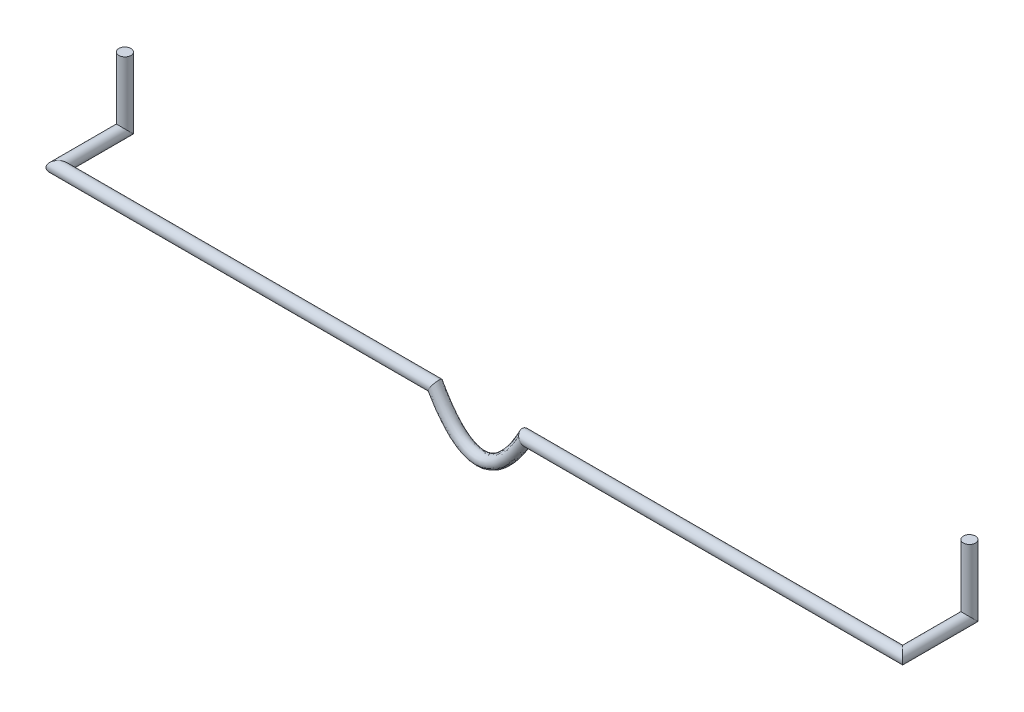
ISO-10303-21;
HEADER;
FILE_DESCRIPTION(('STEP AP214'),'2;1');
FILE_NAME('part.step','',(''),(''),'','','');
FILE_SCHEMA(('AUTOMOTIVE_DESIGN { 1 0 10303 214 1 1 1 1 }'));
ENDSEC;
DATA;
#1=APPLICATION_CONTEXT('core data for automotive mechanical design processes');
#2=APPLICATION_PROTOCOL_DEFINITION('international standard','automotive_design',2000,#1);
#3=PRODUCT_CONTEXT('',#1,'mechanical');
#4=PRODUCT('Part','Part','',(#3));
#5=PRODUCT_RELATED_PRODUCT_CATEGORY('part','',(#4));
#6=PRODUCT_DEFINITION_FORMATION('','',#4);
#7=PRODUCT_DEFINITION_CONTEXT('part definition',#1,'design');
#8=PRODUCT_DEFINITION('design','',#6,#7);
#9=PRODUCT_DEFINITION_SHAPE('','',#8);
#10=(LENGTH_UNIT() NAMED_UNIT(*) SI_UNIT(.MILLI.,.METRE.));
#11=(NAMED_UNIT(*) PLANE_ANGLE_UNIT() SI_UNIT($,.RADIAN.));
#12=(NAMED_UNIT(*) SI_UNIT($,.STERADIAN.) SOLID_ANGLE_UNIT());
#13=UNCERTAINTY_MEASURE_WITH_UNIT(LENGTH_MEASURE(1.E-05),#10,'distance_accuracy_value','');
#14=(GEOMETRIC_REPRESENTATION_CONTEXT(3) GLOBAL_UNCERTAINTY_ASSIGNED_CONTEXT((#13)) GLOBAL_UNIT_ASSIGNED_CONTEXT((#10,
#11,#12)) REPRESENTATION_CONTEXT('',''));
#15=CARTESIAN_POINT('',(0.,0.,0.));
#16=DIRECTION('',(0.,0.,1.));
#17=DIRECTION('',(1.,0.,0.));
#18=AXIS2_PLACEMENT_3D('',#15,#16,#17);
#19=CARTESIAN_POINT('',(450.088,0.,0.));
#20=DIRECTION('',(0.,-1.,0.));
#21=DIRECTION('',(0.,0.,1.));
#22=AXIS2_PLACEMENT_3D('',#19,#20,#21);
#23=PLANE('',#22);
#24=CARTESIAN_POINT('',(450.088,0.,0.));
#25=DIRECTION('',(0.,-1.,0.));
#26=DIRECTION('',(0.,0.,1.));
#27=AXIS2_PLACEMENT_3D('',#24,#25,#26);
#28=CIRCLE('',#27,3.2385);
#29=CARTESIAN_POINT('',(450.088,0.,3.23850000000001));
#30=VERTEX_POINT('',#29);
#31=EDGE_CURVE('E38',#30,#30,#28,.T.);
#32=ORIENTED_EDGE('',*,*,#31,.F.);
#33=EDGE_LOOP('',(#32));
#34=FACE_BOUND('',#33,.T.);
#35=ADVANCED_FACE('F35',(#34),#23,.F.);
#36=CARTESIAN_POINT('',(0.,0.,0.));
#37=DIRECTION('',(0.,1.,0.));
#38=DIRECTION('',(0.,0.,1.));
#39=AXIS2_PLACEMENT_3D('',#36,#37,#38);
#40=PLANE('',#39);
#41=CARTESIAN_POINT('',(0.,0.,0.));
#42=DIRECTION('',(0.,1.,0.));
#43=DIRECTION('',(0.,0.,1.));
#44=AXIS2_PLACEMENT_3D('',#41,#42,#43);
#45=CIRCLE('',#44,3.2385);
#46=CARTESIAN_POINT('',(0.,0.,3.2385));
#47=VERTEX_POINT('',#46);
#48=EDGE_CURVE('E43',#47,#47,#45,.T.);
#49=ORIENTED_EDGE('',*,*,#48,.T.);
#50=EDGE_LOOP('',(#49));
#51=FACE_BOUND('',#50,.T.);
#52=ADVANCED_FACE('F119',(#51),#40,.T.);
#53=CARTESIAN_POINT('',(450.088,-39.22235,0.));
#54=DIRECTION('',(0.,1.,0.));
#55=DIRECTION('',(0.,0.,1.));
#56=AXIS2_PLACEMENT_3D('',#53,#54,#55);
#57=CYLINDRICAL_SURFACE('',#56,3.2385);
#58=CARTESIAN_POINT('',(450.088,-35.56,0.));
#59=DIRECTION('',(0.,0.707106781186548,-0.707106781186548));
#60=DIRECTION('',(0.,-0.707106781186548,-0.707106781186548));
#61=AXIS2_PLACEMENT_3D('',#58,#59,#60);
#62=ELLIPSE('',#61,4.57993062174527,3.2385);
#63=CARTESIAN_POINT('',(450.088,-38.7985,-3.23849999999999));
#64=VERTEX_POINT('',#63);
#65=EDGE_CURVE('E53',#64,#64,#62,.T.);
#66=ORIENTED_EDGE('',*,*,#65,.T.);
#67=EDGE_LOOP('',(#66));
#68=FACE_BOUND('',#67,.T.);
#69=ORIENTED_EDGE('',*,*,#31,.T.);
#70=EDGE_LOOP('',(#69));
#71=FACE_BOUND('',#70,.T.);
#72=ADVANCED_FACE('F121',(#68,#71),#57,.T.);
#73=CARTESIAN_POINT('',(450.088,-35.56,42.7847));
#74=DIRECTION('',(0.,0.,-1.));
#75=DIRECTION('',(-1.,0.,0.));
#76=AXIS2_PLACEMENT_3D('',#73,#74,#75);
#77=CYLINDRICAL_SURFACE('',#76,3.2385);
#78=CARTESIAN_POINT('',(450.088,-35.56,35.56));
#79=DIRECTION('',(0.707106781186547,0.,-0.707106781186547));
#80=DIRECTION('',(0.707106781186548,0.,0.707106781186548));
#81=AXIS2_PLACEMENT_3D('',#78,#79,#80);
#82=ELLIPSE('',#81,4.57993062174527,3.2385);
#83=CARTESIAN_POINT('',(453.3265,-35.56,38.7985));
#84=VERTEX_POINT('',#83);
#85=EDGE_CURVE('E156',#84,#84,#82,.T.);
#86=ORIENTED_EDGE('',*,*,#85,.T.);
#87=EDGE_LOOP('',(#86));
#88=FACE_BOUND('',#87,.T.);
#89=ORIENTED_EDGE('',*,*,#65,.F.);
#90=EDGE_LOOP('',(#89));
#91=FACE_BOUND('',#90,.T.);
#92=ADVANCED_FACE('F126',(#88,#91),#77,.T.);
#93=CARTESIAN_POINT('',(246.983876614171,-35.56,35.56));
#94=DIRECTION('',(1.,0.,0.));
#95=DIRECTION('',(0.,0.,-1.));
#96=AXIS2_PLACEMENT_3D('',#93,#94,#95);
#97=CYLINDRICAL_SURFACE('',#96,3.2385);
#98=CARTESIAN_POINT('',(249.174,-35.56,32.3215));
#99=CARTESIAN_POINT('',(249.176054793598,-35.5635021418316,32.3214999911794));
#100=CARTESIAN_POINT('',(249.178109613021,-35.5670044358151,32.3215056723221));
#101=CARTESIAN_POINT('',(249.31962978746,-35.8082229789254,32.3222888655226));
#102=CARTESIAN_POINT('',(249.459171307487,-36.0465667066486,32.3492749519573));
#103=CARTESIAN_POINT('',(249.733063155369,-36.5153550059829,32.4562661362609));
#104=CARTESIAN_POINT('',(249.867394275573,-36.745770051262,32.5364507091079));
#105=CARTESIAN_POINT('',(250.051458674251,-37.062094172102,32.6889601098426));
#106=CARTESIAN_POINT('',(250.105961927077,-37.1558432220241,32.739949436725));
#107=CARTESIAN_POINT('',(250.212298864574,-37.3388955405039,32.8516993349338));
#108=CARTESIAN_POINT('',(250.26413412718,-37.4282014358144,32.9124540409636));
#109=CARTESIAN_POINT('',(250.364532369726,-37.6013057183687,33.043508505734));
#110=CARTESIAN_POINT('',(250.41309893771,-37.6851101420003,33.1137975342756));
#111=CARTESIAN_POINT('',(250.506400007599,-37.8462182403497,33.263659802093));
#112=CARTESIAN_POINT('',(250.551137133552,-37.9235263658494,33.343226594211));
#113=CARTESIAN_POINT('',(250.631264902887,-38.0620780622159,33.5015438396844));
#114=CARTESIAN_POINT('',(250.667138378603,-38.1241459938176,33.5793292484672));
#115=CARTESIAN_POINT('',(250.734940888716,-38.2415154656424,33.7413859687224));
#116=CARTESIAN_POINT('',(250.766872421391,-38.2968212912571,33.8256531167323));
#117=CARTESIAN_POINT('',(250.826339694067,-38.399863572172,34.0000920438554));
#118=CARTESIAN_POINT('',(250.853878090205,-38.4476046011114,34.0902602082827));
#119=CARTESIAN_POINT('',(250.904137990515,-38.534766900497,34.2758099851822));
#120=CARTESIAN_POINT('',(250.926860407769,-38.5741897480189,34.3711906050799));
#121=CARTESIAN_POINT('',(250.964084600143,-38.6387905317279,34.5516844329536));
#122=CARTESIAN_POINT('',(250.979307208205,-38.6652164525512,34.6362046764752));
#123=CARTESIAN_POINT('',(251.005768714893,-38.7111607831039,34.8077067560079));
#124=CARTESIAN_POINT('',(251.017008205992,-38.7306802201442,34.8946882238416));
#125=CARTESIAN_POINT('',(251.035334362611,-38.7625104831836,35.0703359053587));
#126=CARTESIAN_POINT('',(251.042423587242,-38.7748257513669,35.1590010459667));
#127=CARTESIAN_POINT('',(251.052351554454,-38.7920731911271,35.3372818502735));
#128=CARTESIAN_POINT('',(251.055190581678,-38.7970058571303,35.4268974499136));
#129=CARTESIAN_POINT('',(251.056504555311,-38.7992887822404,35.5970797538976));
#130=CARTESIAN_POINT('',(251.055396094353,-38.7973628537835,35.6776346544125));
#131=CARTESIAN_POINT('',(251.049733649073,-38.7875251927279,35.8382839570606));
#132=CARTESIAN_POINT('',(251.045178512241,-38.7796114579083,35.9183781961278));
#133=CARTESIAN_POINT('',(251.032679418428,-38.7578992041375,36.0774562103693));
#134=CARTESIAN_POINT('',(251.02473725948,-38.7441038075257,36.1564405517963));
#135=CARTESIAN_POINT('',(251.005563831395,-38.7108057651239,36.3127998698258));
#136=CARTESIAN_POINT('',(250.994331322601,-38.6913009682912,36.3901742280702));
#137=CARTESIAN_POINT('',(250.956148056588,-38.6250119383955,36.6174750903641));
#138=CARTESIAN_POINT('',(250.924565700201,-38.5701994573701,36.7643864016023));
#139=CARTESIAN_POINT('',(250.850313232663,-38.4414174128314,37.0464089617557));
#140=CARTESIAN_POINT('',(250.807640232638,-38.3674428580258,37.1815171239342));
#141=CARTESIAN_POINT('',(250.709292943241,-38.1970951613416,37.4468518578101));
#142=CARTESIAN_POINT('',(250.652902068504,-38.0994898768808,37.576020468911));
#143=CARTESIAN_POINT('',(250.531068487855,-37.8888267813352,37.8161010103745));
#144=CARTESIAN_POINT('',(250.465623557042,-37.7757651721674,37.9270084386038));
#145=CARTESIAN_POINT('',(250.319064117692,-37.5228575544848,38.1418301080608));
#146=CARTESIAN_POINT('',(250.237012035037,-37.3814267434941,38.2432368684673));
#147=CARTESIAN_POINT('',(250.066079253296,-37.0871997343628,38.4209700035123));
#148=CARTESIAN_POINT('',(249.977189305048,-36.9343881513634,38.4972616434982));
#149=CARTESIAN_POINT('',(249.773027536255,-36.5839181736976,38.6394876076495));
#150=CARTESIAN_POINT('',(249.656506540645,-36.3842326915118,38.6986511863809));
#151=CARTESIAN_POINT('',(249.420028295055,-35.9797171390477,38.7777721960537));
#152=CARTESIAN_POINT('',(249.300079542122,-35.7748999229585,38.7978192652938));
#153=CARTESIAN_POINT('',(249.178109619621,-35.5670044474191,38.7984943287222));
#154=CARTESIAN_POINT('',(249.176054800142,-35.5635021533456,38.7985000099412));
#155=CARTESIAN_POINT('',(249.174,-35.56,38.7985));
#156=B_SPLINE_CURVE_WITH_KNOTS('',3,(#98,#99,#100,#101,#102,#103,#104,#105,#106,#107,#108,#109,
#110,#111,#112,#113,#114,#115,#116,#117,#118,#119,#120,#121,#122,#123,#124,#125,#126,#127,#128,
#129,#130,#131,#132,#133,#134,#135,#136,#137,#138,#139,#140,#141,#142,#143,#144,#145,#146,#147,
#148,#149,#150,#151,#152,#153,#154,#155),.UNSPECIFIED.,.F.,.F.,(4,2,2,2,2,2,2,2,2,2,2,2,2,2,2,2,
2,2,2,2,2,2,2,2,2,2,2,2,4),(0.,0.0121817468272182,0.838978375580289,1.66857863758955,
2.02766056791721,2.38652762633704,2.74499410560405,3.10321295306018,3.42010056530765,
3.73678630187669,4.05327983516158,4.36971330920602,4.63890659631463,4.9080598251864,
5.17704691526329,5.44601598997284,5.68747959453372,5.92902397613135,6.17044029081306,
6.41194767752567,6.88953845192276,7.36725375336719,7.87948384114254,8.39184002624056,
8.96675729627666,9.5424663788564,10.2549997208453,10.9658983147959,10.9780800616231),.UNSPECIFIED.);
#157=CARTESIAN_POINT('',(249.174,-35.56,38.7985));
#158=VERTEX_POINT('',#157);
#159=CARTESIAN_POINT('',(249.174,-35.56,32.3215));
#160=VERTEX_POINT('',#159);
#161=EDGE_CURVE('E149',#158,#160,#156,.F.);
#162=ORIENTED_EDGE('',*,*,#161,.T.);
#163=CARTESIAN_POINT('',(249.174,-35.56,32.3215));
#164=CARTESIAN_POINT('',(249.171945213293,-35.5564978682451,32.3214999837679));
#165=CARTESIAN_POINT('',(249.169890347293,-35.5529956013949,32.3215056650182));
#166=CARTESIAN_POINT('',(249.028389998365,-35.3118256300815,32.3222891951487));
#167=CARTESIAN_POINT('',(248.888623556809,-35.0736111193781,32.3492974925519));
#168=CARTESIAN_POINT('',(248.613948014755,-34.6054611377014,32.4560166167605));
#169=CARTESIAN_POINT('',(248.479057883621,-34.3755579987345,32.5359138775273));
#170=CARTESIAN_POINT('',(248.237341815006,-33.9635837293388,32.7343466571205));
#171=CARTESIAN_POINT('',(248.129166407045,-33.7792125780881,32.8463531464433));
#172=CARTESIAN_POINT('',(247.976660293052,-33.5192854396645,33.0430217640365));
#173=CARTESIAN_POINT('',(247.927482643797,-33.435468440985,33.1132942335546));
#174=CARTESIAN_POINT('',(247.832915573043,-33.2742909972513,33.2631514878196));
#175=CARTESIAN_POINT('',(247.787524902778,-33.1969284238355,33.3427331818691));
#176=CARTESIAN_POINT('',(247.679976521654,-33.0136260079178,33.5521199929948));
#177=CARTESIAN_POINT('',(247.62051088677,-32.9122744636119,33.687417374918));
#178=CARTESIAN_POINT('',(247.513758859446,-32.730329324062,33.9757546300036));
#179=CARTESIAN_POINT('',(247.466467581209,-32.6497274016066,34.1287873497745));
#180=CARTESIAN_POINT('',(247.406252993354,-32.5470993494495,34.3692009369565));
#181=CARTESIAN_POINT('',(247.387927894092,-32.5158665640456,34.4514259221336));
#182=CARTESIAN_POINT('',(247.355163107504,-32.4600231791349,34.6188330782863));
#183=CARTESIAN_POINT('',(247.340721699881,-32.4354096476039,34.7040139210125));
#184=CARTESIAN_POINT('',(247.315937081256,-32.3931674355364,34.876659381071));
#185=CARTESIAN_POINT('',(247.305593336275,-32.3755378449005,34.9641236992519));
#186=CARTESIAN_POINT('',(247.289160407993,-32.3475300196434,35.1405988731597));
#187=CARTESIAN_POINT('',(247.283070825407,-32.3371511044917,35.2296095829422));
#188=CARTESIAN_POINT('',(247.275612558397,-32.3244394416378,35.3999341296419));
#189=CARTESIAN_POINT('',(247.273852726356,-32.3214400328216,35.4811819532342));
#190=CARTESIAN_POINT('',(247.273924174053,-32.3215618062897,35.6436990936885));
#191=CARTESIAN_POINT('',(247.275756622393,-32.3246849803074,35.7249684089426));
#192=CARTESIAN_POINT('',(247.282990298802,-32.337013857184,35.8868395824483));
#193=CARTESIAN_POINT('',(247.288389435746,-32.3462159959868,35.9674418037926));
#194=CARTESIAN_POINT('',(247.302679066289,-32.3705708443322,36.1274377995936));
#195=CARTESIAN_POINT('',(247.311570868166,-32.3857257836662,36.206831109629));
#196=CARTESIAN_POINT('',(247.34271858585,-32.4388130845184,36.4377615729592));
#197=CARTESIAN_POINT('',(247.369678245275,-32.484762374472,36.5869223101215));
#198=CARTESIAN_POINT('',(247.435168836419,-32.5963827009173,36.8748206768314));
#199=CARTESIAN_POINT('',(247.473701377382,-32.6620564801599,37.0135568534554));
#200=CARTESIAN_POINT('',(247.563493436736,-32.8150955335594,37.2860465434251));
#201=CARTESIAN_POINT('',(247.615382771213,-32.903534248091,37.4189884379396));
#202=CARTESIAN_POINT('',(247.728604618019,-33.0965063589356,37.6680690191151));
#203=CARTESIAN_POINT('',(247.78994247923,-33.2010488717331,37.784198115232));
#204=CARTESIAN_POINT('',(247.938344749701,-33.4539815060241,38.0280714538393));
#205=CARTESIAN_POINT('',(248.027824901542,-33.6064889532536,38.1500963868259));
#206=CARTESIAN_POINT('',(248.21582326388,-33.9269081157611,38.3632150839157));
#207=CARTESIAN_POINT('',(248.314353835345,-34.0948408988023,38.4542657212734));
#208=CARTESIAN_POINT('',(248.517806886678,-34.4416007726793,38.6051581706439));
#209=CARTESIAN_POINT('',(248.622756008262,-34.6204732714373,38.6648584355252));
#210=CARTESIAN_POINT('',(248.83581233235,-34.9836010050364,38.752243950905));
#211=CARTESIAN_POINT('',(248.943912446583,-35.1678441584245,38.7799961120667));
#212=CARTESIAN_POINT('',(249.090814255314,-35.4182201287759,38.796062910066));
#213=CARTESIAN_POINT('',(249.129323321355,-35.4838540865247,38.7982700759019));
#214=CARTESIAN_POINT('',(249.169890267754,-35.5529954658341,38.798494314651));
#215=CARTESIAN_POINT('',(249.171945132542,-35.5564977306174,38.798499995634));
#216=CARTESIAN_POINT('',(249.174,-35.56,38.7985));
#217=B_SPLINE_CURVE_WITH_KNOTS('',3,(#163,#164,#165,#166,#167,#168,#169,#170,#171,#172,#173,
#174,#175,#176,#177,#178,#179,#180,#181,#182,#183,#184,#185,#186,#187,#188,#189,#190,#191,#192,
#193,#194,#195,#196,#197,#198,#199,#200,#201,#202,#203,#204,#205,#206,#207,#208,#209,#210,#211,
#212,#213,#214,#215,#216),.UNSPECIFIED.,.F.,.F.,(4,2,2,2,2,2,2,2,2,2,2,2,2,2,2,2,2,2,2,2,2,2,2,
2,2,2,4),(0.,0.0121817468258203,0.83882012122341,1.66838802991481,2.38794438908327,
2.74721125631778,3.10635918234611,3.64161425634175,4.17665418641377,4.44587587501839,
4.71497811367022,4.98404527321504,5.25308717538099,5.49674950329641,5.74049111000327,
5.98408993932789,6.22778010269881,6.70066440791065,7.17361449961028,7.6752292776498,
8.17712907442298,8.81830460586731,9.46036925228998,10.1053084270353,10.7488943987881,
10.9772045538368,10.9893863006626),.UNSPECIFIED.);
#218=EDGE_CURVE('E144',#158,#160,#217,.F.);
#219=ORIENTED_EDGE('',*,*,#218,.F.);
#220=EDGE_LOOP('',(#162,#219));
#221=FACE_BOUND('',#220,.T.);
#222=ORIENTED_EDGE('',*,*,#85,.F.);
#223=EDGE_LOOP('',(#222));
#224=FACE_BOUND('',#223,.T.);
#225=ADVANCED_FACE('F133',(#221,#224),#97,.T.);
#226=CARTESIAN_POINT('',(202.672638503373,-32.0683365984661,35.56));
#227=CARTESIAN_POINT('',(203.028768157886,-32.705621243379,35.56));
#228=CARTESIAN_POINT('',(203.389862392291,-33.3517930044988,35.56));
#229=CARTESIAN_POINT('',(204.236727859011,-34.8672289202754,35.56));
#230=CARTESIAN_POINT('',(204.717414884227,-35.7000764376528,35.5600000000068));
#231=CARTESIAN_POINT('',(205.69041920407,-37.3324192111855,35.5599999999932));
#232=CARTESIAN_POINT('',(206.17572943045,-38.119378593035,35.56));
#233=CARTESIAN_POINT('',(207.627373700757,-40.3923479111062,35.56));
#234=CARTESIAN_POINT('',(208.589483686795,-41.7904289376061,35.56));
#235=CARTESIAN_POINT('',(211.451225238088,-45.6311873356943,35.56));
#236=CARTESIAN_POINT('',(213.327466144928,-47.7187132096921,35.56));
#237=CARTESIAN_POINT('',(216.949364159858,-50.9593588026057,35.56));
#238=CARTESIAN_POINT('',(218.690477057805,-52.1092057413648,35.56));
#239=CARTESIAN_POINT('',(221.977509913193,-53.5797204411117,35.56));
#240=CARTESIAN_POINT('',(223.51610087558,-53.911499999993,35.56));
#241=CARTESIAN_POINT('',(226.571899124016,-53.9115000000069,35.56));
#242=CARTESIAN_POINT('',(228.110490086803,-53.5797204410834,35.56));
#243=CARTESIAN_POINT('',(231.3975229422,-52.1092057413932,35.56));
#244=CARTESIAN_POINT('',(233.138635840067,-50.9593588026152,35.56));
#245=CARTESIAN_POINT('',(236.760533855147,-47.7187132096828,35.56));
#246=CARTESIAN_POINT('',(238.636774761823,-45.6311873357237,35.56));
#247=CARTESIAN_POINT('',(241.498516313249,-41.7904289375915,35.56));
#248=CARTESIAN_POINT('',(242.460626299243,-40.3923479111063,35.56));
#249=CARTESIAN_POINT('',(243.91227056955,-38.1193785930351,35.56));
#250=CARTESIAN_POINT('',(244.397580795905,-37.3324192111887,35.56));
#251=CARTESIAN_POINT('',(245.370585115798,-35.7000764376497,35.56));
#252=CARTESIAN_POINT('',(245.851272141004,-34.8672289202799,35.56));
#253=CARTESIAN_POINT('',(246.698137607698,-33.3517930044956,35.56));
#254=CARTESIAN_POINT('',(247.059231842077,-32.7056212434168,35.56));
#255=CARTESIAN_POINT('',(247.415361496627,-32.0683365984661,35.56));
#256=CARTESIAN_POINT('',(202.672638503373,-32.0683365984661,29.083));
#257=CARTESIAN_POINT('',(203.028768157886,-32.705621243379,29.083));
#258=CARTESIAN_POINT('',(203.389862392291,-33.3517930044988,29.083));
#259=CARTESIAN_POINT('',(204.236727859011,-34.8672289202754,29.083));
#260=CARTESIAN_POINT('',(204.717414884227,-35.7000764376528,29.0830000000068));
#261=CARTESIAN_POINT('',(205.69041920407,-37.3324192111855,29.0829999999932));
#262=CARTESIAN_POINT('',(206.17572943045,-38.119378593035,29.083));
#263=CARTESIAN_POINT('',(207.627373700757,-40.3923479111062,29.083));
#264=CARTESIAN_POINT('',(208.589483686795,-41.7904289376061,29.083));
#265=CARTESIAN_POINT('',(211.451225238088,-45.6311873356943,29.083));
#266=CARTESIAN_POINT('',(213.327466144928,-47.7187132096921,29.083));
#267=CARTESIAN_POINT('',(216.949364159858,-50.9593588026057,29.083));
#268=CARTESIAN_POINT('',(218.690477057805,-52.1092057413648,29.083));
#269=CARTESIAN_POINT('',(221.977509913193,-53.5797204411117,29.083));
#270=CARTESIAN_POINT('',(223.51610087558,-53.911499999993,29.083));
#271=CARTESIAN_POINT('',(226.571899124016,-53.9115000000069,29.083));
#272=CARTESIAN_POINT('',(228.110490086803,-53.5797204410834,29.083));
#273=CARTESIAN_POINT('',(231.3975229422,-52.1092057413932,29.083));
#274=CARTESIAN_POINT('',(233.138635840067,-50.9593588026152,29.083));
#275=CARTESIAN_POINT('',(236.760533855147,-47.7187132096828,29.083));
#276=CARTESIAN_POINT('',(238.636774761823,-45.6311873357237,29.083));
#277=CARTESIAN_POINT('',(241.498516313249,-41.7904289375915,29.083));
#278=CARTESIAN_POINT('',(242.460626299243,-40.3923479111063,29.083));
#279=CARTESIAN_POINT('',(243.91227056955,-38.1193785930351,29.083));
#280=CARTESIAN_POINT('',(244.397580795905,-37.3324192111887,29.083));
#281=CARTESIAN_POINT('',(245.370585115798,-35.7000764376497,29.083));
#282=CARTESIAN_POINT('',(245.851272141004,-34.8672289202799,29.083));
#283=CARTESIAN_POINT('',(246.698137607698,-33.3517930044956,29.083));
#284=CARTESIAN_POINT('',(247.059231842077,-32.7056212434168,29.083));
#285=CARTESIAN_POINT('',(247.415361496627,-32.0683365984661,29.083));
#286=CARTESIAN_POINT('',(197.01858356957,-35.2279555320619,29.083));
#287=CARTESIAN_POINT('',(197.374713224083,-35.8652401769748,29.083));
#288=CARTESIAN_POINT('',(197.725878298663,-36.49364414748,29.083));
#289=CARTESIAN_POINT('',(198.596688807694,-38.0519286532199,29.083));
#290=CARTESIAN_POINT('',(199.121418449159,-38.9620329373636,29.0830000000068));
#291=CARTESIAN_POINT('',(200.159247462543,-40.7031276637979,29.0829999999932));
#292=CARTESIAN_POINT('',(200.679353902884,-41.5466630736274,29.083));
#293=CARTESIAN_POINT('',(202.243959632575,-43.9965062555686,29.083));
#294=CARTESIAN_POINT('',(203.292682979943,-45.5220710624135,29.083));
#295=CARTESIAN_POINT('',(206.463441428437,-49.7775626642662,29.083));
#296=CARTESIAN_POINT('',(208.608867188424,-52.1879534569914,29.083));
#297=CARTESIAN_POINT('',(213.03030250679,-56.1439745307106,29.083));
#298=CARTESIAN_POINT('',(215.3108562755,-57.6928775919276,29.083));
#299=CARTESIAN_POINT('',(220.067156753502,-59.8206962255957,29.083));
#300=CARTESIAN_POINT('',(222.550232457053,-60.3884999999895,29.083));
#301=CARTESIAN_POINT('',(227.537767542289,-60.3885000000104,29.083));
#302=CARTESIAN_POINT('',(230.020843246491,-59.8206962255721,29.083));
#303=CARTESIAN_POINT('',(234.777143724507,-57.6928775919513,29.083));
#304=CARTESIAN_POINT('',(237.057697493135,-56.1439745307013,29.083));
#305=CARTESIAN_POINT('',(241.479132811651,-52.1879534570008,29.083));
#306=CARTESIAN_POINT('',(243.624558571474,-49.7775626642716,29.083));
#307=CARTESIAN_POINT('',(246.795317020102,-45.5220710624109,29.083));
#308=CARTESIAN_POINT('',(247.844040367477,-43.9965062555557,29.083));
#309=CARTESIAN_POINT('',(249.40864609709,-41.5466630736339,29.083));
#310=CARTESIAN_POINT('',(249.928752537445,-40.7031276638009,29.083));
#311=CARTESIAN_POINT('',(250.966581550852,-38.9620329373607,29.083));
#312=CARTESIAN_POINT('',(251.491311192322,-38.0519286532157,29.083));
#313=CARTESIAN_POINT('',(252.362121701326,-36.493644147483,29.083));
#314=CARTESIAN_POINT('',(252.71328677588,-35.8652401770127,29.083));
#315=CARTESIAN_POINT('',(253.06941643043,-35.2279555320619,29.083));
#316=CARTESIAN_POINT('',(197.01858356957,-35.2279555320619,35.56));
#317=CARTESIAN_POINT('',(197.374713224083,-35.8652401769748,35.56));
#318=CARTESIAN_POINT('',(197.725878298663,-36.49364414748,35.56));
#319=CARTESIAN_POINT('',(198.596688807694,-38.0519286532199,35.56));
#320=CARTESIAN_POINT('',(199.121418449159,-38.9620329373636,35.5600000000068));
#321=CARTESIAN_POINT('',(200.159247462543,-40.7031276637979,35.5599999999932));
#322=CARTESIAN_POINT('',(200.679353902884,-41.5466630736274,35.56));
#323=CARTESIAN_POINT('',(202.243959632575,-43.9965062555686,35.56));
#324=CARTESIAN_POINT('',(203.292682979943,-45.5220710624135,35.56));
#325=CARTESIAN_POINT('',(206.463441428437,-49.7775626642662,35.56));
#326=CARTESIAN_POINT('',(208.608867188424,-52.1879534569914,35.56));
#327=CARTESIAN_POINT('',(213.03030250679,-56.1439745307106,35.56));
#328=CARTESIAN_POINT('',(215.3108562755,-57.6928775919276,35.56));
#329=CARTESIAN_POINT('',(220.067156753502,-59.8206962255957,35.56));
#330=CARTESIAN_POINT('',(222.550232457053,-60.388499999993,35.56));
#331=CARTESIAN_POINT('',(227.537767542289,-60.3885000000069,35.56));
#332=CARTESIAN_POINT('',(230.020843246491,-59.8206962255683,35.56));
#333=CARTESIAN_POINT('',(234.777143724507,-57.6928775919551,35.56));
#334=CARTESIAN_POINT('',(237.057697493135,-56.1439745307013,35.56));
#335=CARTESIAN_POINT('',(241.479132811651,-52.1879534570008,35.56));
#336=CARTESIAN_POINT('',(243.624558571474,-49.7775626642716,35.56));
#337=CARTESIAN_POINT('',(246.795317020102,-45.5220710624109,35.56));
#338=CARTESIAN_POINT('',(247.844040367477,-43.9965062555557,35.56));
#339=CARTESIAN_POINT('',(249.40864609709,-41.5466630736339,35.56));
#340=CARTESIAN_POINT('',(249.928752537445,-40.7031276638009,35.56));
#341=CARTESIAN_POINT('',(250.966581550852,-38.9620329373607,35.56));
#342=CARTESIAN_POINT('',(251.491311192322,-38.0519286532175,35.56));
#343=CARTESIAN_POINT('',(252.362121701326,-36.4936441474818,35.56));
#344=CARTESIAN_POINT('',(252.71328677588,-35.8652401770127,35.56));
#345=CARTESIAN_POINT('',(253.06941643043,-35.2279555320619,35.56));
#346=CARTESIAN_POINT('',(197.01858356957,-35.2279555320619,42.037));
#347=CARTESIAN_POINT('',(197.374713224083,-35.8652401769748,42.037));
#348=CARTESIAN_POINT('',(197.725878298663,-36.49364414748,42.037));
#349=CARTESIAN_POINT('',(198.596688807694,-38.0519286532199,42.037));
#350=CARTESIAN_POINT('',(199.121418449159,-38.9620329373636,42.0370000000068));
#351=CARTESIAN_POINT('',(200.159247462543,-40.7031276637979,42.0369999999932));
#352=CARTESIAN_POINT('',(200.679353902884,-41.5466630736274,42.037));
#353=CARTESIAN_POINT('',(202.243959632575,-43.9965062555686,42.037));
#354=CARTESIAN_POINT('',(203.292682979943,-45.5220710624135,42.037));
#355=CARTESIAN_POINT('',(206.463441428437,-49.7775626642662,42.037));
#356=CARTESIAN_POINT('',(208.608867188424,-52.1879534569914,42.037));
#357=CARTESIAN_POINT('',(213.03030250679,-56.1439745307106,42.037));
#358=CARTESIAN_POINT('',(215.3108562755,-57.6928775919276,42.037));
#359=CARTESIAN_POINT('',(220.067156753502,-59.8206962255957,42.037));
#360=CARTESIAN_POINT('',(222.550232457053,-60.3884999999965,42.037));
#361=CARTESIAN_POINT('',(227.537767542289,-60.3885000000035,42.037));
#362=CARTESIAN_POINT('',(230.020843246491,-59.8206962255645,42.037));
#363=CARTESIAN_POINT('',(234.777143724507,-57.692877591959,42.037));
#364=CARTESIAN_POINT('',(237.057697493135,-56.1439745307013,42.037));
#365=CARTESIAN_POINT('',(241.479132811651,-52.1879534570008,42.037));
#366=CARTESIAN_POINT('',(243.624558571474,-49.7775626642716,42.037));
#367=CARTESIAN_POINT('',(246.795317020102,-45.5220710624109,42.037));
#368=CARTESIAN_POINT('',(247.844040367477,-43.9965062555557,42.037));
#369=CARTESIAN_POINT('',(249.40864609709,-41.5466630736339,42.037));
#370=CARTESIAN_POINT('',(249.928752537445,-40.7031276638009,42.037));
#371=CARTESIAN_POINT('',(250.966581550852,-38.9620329373607,42.037));
#372=CARTESIAN_POINT('',(251.491311192322,-38.0519286532193,42.037));
#373=CARTESIAN_POINT('',(252.362121701326,-36.4936441474805,42.037));
#374=CARTESIAN_POINT('',(252.71328677588,-35.8652401770127,42.037));
#375=CARTESIAN_POINT('',(253.06941643043,-35.2279555320619,42.037));
#376=CARTESIAN_POINT('',(202.672638503373,-32.0683365984661,42.037));
#377=CARTESIAN_POINT('',(203.028768157886,-32.705621243379,42.037));
#378=CARTESIAN_POINT('',(203.389862392291,-33.3517930044988,42.037));
#379=CARTESIAN_POINT('',(204.236727859011,-34.8672289202754,42.037));
#380=CARTESIAN_POINT('',(204.717414884227,-35.7000764376528,42.0370000000068));
#381=CARTESIAN_POINT('',(205.69041920407,-37.3324192111855,42.0369999999932));
#382=CARTESIAN_POINT('',(206.17572943045,-38.119378593035,42.037));
#383=CARTESIAN_POINT('',(207.627373700757,-40.3923479111062,42.037));
#384=CARTESIAN_POINT('',(208.589483686795,-41.7904289376061,42.037));
#385=CARTESIAN_POINT('',(211.451225238088,-45.6311873356943,42.037));
#386=CARTESIAN_POINT('',(213.327466144928,-47.7187132096921,42.037));
#387=CARTESIAN_POINT('',(216.949364159858,-50.9593588026057,42.037));
#388=CARTESIAN_POINT('',(218.690477057805,-52.1092057413648,42.037));
#389=CARTESIAN_POINT('',(221.977509913193,-53.5797204411117,42.037));
#390=CARTESIAN_POINT('',(223.51610087558,-53.911499999993,42.037));
#391=CARTESIAN_POINT('',(226.571899124016,-53.9115000000069,42.037));
#392=CARTESIAN_POINT('',(228.110490086803,-53.5797204410834,42.037));
#393=CARTESIAN_POINT('',(231.3975229422,-52.1092057413932,42.037));
#394=CARTESIAN_POINT('',(233.138635840067,-50.9593588026152,42.037));
#395=CARTESIAN_POINT('',(236.760533855147,-47.7187132096828,42.037));
#396=CARTESIAN_POINT('',(238.636774761823,-45.6311873357237,42.037));
#397=CARTESIAN_POINT('',(241.498516313249,-41.7904289375915,42.037));
#398=CARTESIAN_POINT('',(242.460626299243,-40.3923479111063,42.037));
#399=CARTESIAN_POINT('',(243.91227056955,-38.1193785930351,42.037));
#400=CARTESIAN_POINT('',(244.397580795905,-37.3324192111887,42.037));
#401=CARTESIAN_POINT('',(245.370585115798,-35.7000764376497,42.037));
#402=CARTESIAN_POINT('',(245.851272141004,-34.8672289202799,42.037));
#403=CARTESIAN_POINT('',(246.698137607698,-33.3517930044956,42.037));
#404=CARTESIAN_POINT('',(247.059231842077,-32.7056212434168,42.037));
#405=CARTESIAN_POINT('',(247.415361496627,-32.0683365984661,42.037));
#406=CARTESIAN_POINT('',(202.672638503373,-32.0683365984661,35.56));
#407=CARTESIAN_POINT('',(203.028768157886,-32.705621243379,35.56));
#408=CARTESIAN_POINT('',(203.389862392291,-33.3517930044988,35.56));
#409=CARTESIAN_POINT('',(204.236727859011,-34.8672289202754,35.56));
#410=CARTESIAN_POINT('',(204.717414884227,-35.7000764376528,35.5600000000068));
#411=CARTESIAN_POINT('',(205.69041920407,-37.3324192111855,35.5599999999932));
#412=CARTESIAN_POINT('',(206.17572943045,-38.119378593035,35.56));
#413=CARTESIAN_POINT('',(207.627373700757,-40.3923479111062,35.56));
#414=CARTESIAN_POINT('',(208.589483686795,-41.7904289376061,35.56));
#415=CARTESIAN_POINT('',(211.451225238088,-45.6311873356943,35.56));
#416=CARTESIAN_POINT('',(213.327466144928,-47.7187132096921,35.56));
#417=CARTESIAN_POINT('',(216.949364159858,-50.9593588026057,35.56));
#418=CARTESIAN_POINT('',(218.690477057805,-52.1092057413648,35.56));
#419=CARTESIAN_POINT('',(221.977509913193,-53.5797204411117,35.56));
#420=CARTESIAN_POINT('',(223.51610087558,-53.911499999993,35.56));
#421=CARTESIAN_POINT('',(226.571899124016,-53.9115000000069,35.56));
#422=CARTESIAN_POINT('',(228.110490086803,-53.5797204410834,35.56));
#423=CARTESIAN_POINT('',(231.3975229422,-52.1092057413932,35.56));
#424=CARTESIAN_POINT('',(233.138635840067,-50.9593588026152,35.56));
#425=CARTESIAN_POINT('',(236.760533855147,-47.7187132096828,35.56));
#426=CARTESIAN_POINT('',(238.636774761823,-45.6311873357237,35.56));
#427=CARTESIAN_POINT('',(241.498516313249,-41.7904289375915,35.56));
#428=CARTESIAN_POINT('',(242.460626299243,-40.3923479111063,35.56));
#429=CARTESIAN_POINT('',(243.91227056955,-38.1193785930351,35.56));
#430=CARTESIAN_POINT('',(244.397580795905,-37.3324192111887,35.56));
#431=CARTESIAN_POINT('',(245.370585115798,-35.7000764376497,35.56));
#432=CARTESIAN_POINT('',(245.851272141004,-34.8672289202799,35.56));
#433=CARTESIAN_POINT('',(246.698137607698,-33.3517930044956,35.56));
#434=CARTESIAN_POINT('',(247.059231842077,-32.7056212434168,35.56));
#435=CARTESIAN_POINT('',(247.415361496627,-32.0683365984661,35.56));
#436=(BOUNDED_SURFACE() B_SPLINE_SURFACE(3,3,((#226,#227,#228,#229,#230,#231,#232,#233,#234,
#235,#236,#237,#238,#239,#240,#241,#242,#243,#244,#245,#246,#247,#248,#249,#250,#251,#252,#253,
#254,#255),(#256,#257,#258,#259,#260,#261,#262,#263,#264,#265,#266,#267,#268,#269,#270,#271,
#272,#273,#274,#275,#276,#277,#278,#279,#280,#281,#282,#283,#284,#285),(#286,#287,#288,#289,
#290,#291,#292,#293,#294,#295,#296,#297,#298,#299,#300,#301,#302,#303,#304,#305,#306,#307,#308,
#309,#310,#311,#312,#313,#314,#315),(#316,#317,#318,#319,#320,#321,#322,#323,#324,#325,#326,
#327,#328,#329,#330,#331,#332,#333,#334,#335,#336,#337,#338,#339,#340,#341,#342,#343,#344,#345),
(#346,#347,#348,#349,#350,#351,#352,#353,#354,#355,#356,#357,#358,#359,#360,#361,#362,#363,#364,
#365,#366,#367,#368,#369,#370,#371,#372,#373,#374,#375),(#376,#377,#378,#379,#380,#381,#382,
#383,#384,#385,#386,#387,#388,#389,#390,#391,#392,#393,#394,#395,#396,#397,#398,#399,#400,#401,
#402,#403,#404,#405),(#406,#407,#408,#409,#410,#411,#412,#413,#414,#415,#416,#417,#418,#419,
#420,#421,#422,#423,#424,#425,#426,#427,#428,#429,#430,#431,#432,#433,#434,#435)),.UNSPECIFIED.,
.T.,.F.,.F.) B_SPLINE_SURFACE_WITH_KNOTS((4,3,4),(4,2,2,2,2,2,2,2,2,2,2,2,2,2,4),(0.,0.5,1.),
(-0.0221381882206578,0.,0.03125,0.0625,0.125,0.25,0.375,0.5,0.625,0.75,0.875,0.9375,0.96875,1.,
1.02213818822066),.UNSPECIFIED.) GEOMETRIC_REPRESENTATION_ITEM() RATIONAL_B_SPLINE_SURFACE(((1.,
1.,1.,1.,1.,1.,1.,1.,1.,1.,1.,1.,1.,1.,1.,1.,1.,1.,1.,1.,1.,1.,1.,1.,1.,1.,1.,1.,1.,1.),
(0.333333333333333,0.333333333333333,0.333333333333333,0.333333333333333,0.333333333333333,
0.333333333333333,0.333333333333333,0.333333333333333,0.333333333333333,0.333333333333333,
0.333333333333333,0.333333333333333,0.333333333333333,0.333333333333333,0.333333333333333,
0.333333333333333,0.333333333333333,0.333333333333333,0.333333333333333,0.333333333333333,
0.333333333333333,0.333333333333333,0.333333333333333,0.333333333333333,0.333333333333333,
0.333333333333333,0.333333333333333,0.333333333333333,0.333333333333333,0.333333333333333),
(0.333333333333333,0.333333333333333,0.333333333333333,0.333333333333333,0.333333333333333,
0.333333333333333,0.333333333333333,0.333333333333333,0.333333333333333,0.333333333333333,
0.333333333333333,0.333333333333333,0.333333333333333,0.333333333333333,0.333333333333333,
0.333333333333333,0.333333333333333,0.333333333333333,0.333333333333333,0.333333333333333,
0.333333333333333,0.333333333333333,0.333333333333333,0.333333333333333,0.333333333333333,
0.333333333333333,0.333333333333333,0.333333333333333,0.333333333333333,0.333333333333333),(1.,
1.,1.,1.,1.,1.,1.,1.,1.,1.,1.,1.,1.,1.,1.,1.,1.,1.,1.,1.,1.,1.,1.,1.,1.,1.,1.,1.,1.,1.),
(0.333333333333333,0.333333333333333,0.333333333333333,0.333333333333333,0.333333333333333,
0.333333333333333,0.333333333333333,0.333333333333333,0.333333333333333,0.333333333333333,
0.333333333333333,0.333333333333333,0.333333333333333,0.333333333333333,0.333333333333333,
0.333333333333333,0.333333333333333,0.333333333333333,0.333333333333333,0.333333333333333,
0.333333333333333,0.333333333333333,0.333333333333333,0.333333333333333,0.333333333333333,
0.333333333333333,0.333333333333333,0.333333333333333,0.333333333333333,0.333333333333333),
(0.333333333333333,0.333333333333333,0.333333333333333,0.333333333333333,0.333333333333333,
0.333333333333333,0.333333333333333,0.333333333333333,0.333333333333333,0.333333333333333,
0.333333333333333,0.333333333333333,0.333333333333333,0.333333333333333,0.333333333333333,
0.333333333333333,0.333333333333333,0.333333333333333,0.333333333333333,0.333333333333333,
0.333333333333333,0.333333333333333,0.333333333333333,0.333333333333333,0.333333333333333,
0.333333333333333,0.333333333333333,0.333333333333333,0.333333333333333,0.333333333333333),(1.,
1.,1.,1.,1.,1.,1.,1.,1.,1.,1.,1.,1.,1.,1.,1.,1.,1.,1.,1.,1.,1.,1.,1.,1.,1.,1.,1.,1.,1.))) REPRESENTATION_ITEM('') SURFACE());
#437=CARTESIAN_POINT('',(200.914,-35.56,32.3215));
#438=CARTESIAN_POINT('',(200.911945206401,-35.5635021418313,32.3214999911794));
#439=CARTESIAN_POINT('',(200.909890386978,-35.5670044358145,32.3215056723221));
#440=CARTESIAN_POINT('',(200.768370212497,-35.8082229789003,32.322288865523));
#441=CARTESIAN_POINT('',(200.628828692505,-36.0465667066441,32.3492749519577));
#442=CARTESIAN_POINT('',(200.35493684465,-36.5153550059937,32.4562661362619));
#443=CARTESIAN_POINT('',(200.220605724436,-36.7457700512674,32.5364507091095));
#444=CARTESIAN_POINT('',(200.036541325757,-37.062094172106,32.688960109845));
#445=CARTESIAN_POINT('',(199.982038072932,-37.1558432220285,32.7399494367275));
#446=CARTESIAN_POINT('',(199.875701135435,-37.3388955405084,32.8516993349367));
#447=CARTESIAN_POINT('',(199.82386587283,-37.4282014358187,32.9124540409667));
#448=CARTESIAN_POINT('',(199.723467630284,-37.6013057183728,33.0435085057373));
#449=CARTESIAN_POINT('',(199.6749010623,-37.6851101420042,33.113797534279));
#450=CARTESIAN_POINT('',(199.581599992411,-37.8462182403533,33.2636598020966));
#451=CARTESIAN_POINT('',(199.536862866458,-37.9235263658528,33.3432265942146));
#452=CARTESIAN_POINT('',(199.456735097123,-38.0620780622191,33.5015438396883));
#453=CARTESIAN_POINT('',(199.420861621407,-38.1241459938208,33.5793292484713));
#454=CARTESIAN_POINT('',(199.353059111294,-38.2415154656455,33.741385968727));
#455=CARTESIAN_POINT('',(199.321127578619,-38.2968212912602,33.8256531167371));
#456=CARTESIAN_POINT('',(199.261660305943,-38.3998635721749,34.0000920438606));
#457=CARTESIAN_POINT('',(199.234121909803,-38.4476046011142,34.0902602082882));
#458=CARTESIAN_POINT('',(199.183862009494,-38.5347669004996,34.2758099851881));
#459=CARTESIAN_POINT('',(199.16113959224,-38.5741897480214,34.3711906050861));
#460=CARTESIAN_POINT('',(199.123915399865,-38.63879053173,34.5516844329602));
#461=CARTESIAN_POINT('',(199.108692791803,-38.6652164525532,34.636204676482));
#462=CARTESIAN_POINT('',(199.082231285115,-38.7111607831056,34.8077067560149));
#463=CARTESIAN_POINT('',(199.070991794016,-38.7306802201457,34.8946882238487));
#464=CARTESIAN_POINT('',(199.052665637397,-38.7625104831847,35.070335905366));
#465=CARTESIAN_POINT('',(199.045576412766,-38.7748257513679,35.1590010459741));
#466=CARTESIAN_POINT('',(199.035648445554,-38.7920731911276,35.3372818502812));
#467=CARTESIAN_POINT('',(199.03280941833,-38.7970058571307,35.4268974499214));
#468=CARTESIAN_POINT('',(199.031495444697,-38.7992887822403,35.5970797539053));
#469=CARTESIAN_POINT('',(199.032603905655,-38.7973628537833,35.6776346544202));
#470=CARTESIAN_POINT('',(199.038266350935,-38.7875251927273,35.8382839570681));
#471=CARTESIAN_POINT('',(199.042821487767,-38.7796114579074,35.9183781961352));
#472=CARTESIAN_POINT('',(199.055320581581,-38.7578992041364,36.0774562103764));
#473=CARTESIAN_POINT('',(199.063262740528,-38.7441038075244,36.1564405518034));
#474=CARTESIAN_POINT('',(199.082436168614,-38.7108057651223,36.3127998698326));
#475=CARTESIAN_POINT('',(199.093668677408,-38.6913009682894,36.3901742280768));
#476=CARTESIAN_POINT('',(199.131851943421,-38.6250119383934,36.6174750903704));
#477=CARTESIAN_POINT('',(199.163434299808,-38.5701994573677,36.7643864016082));
#478=CARTESIAN_POINT('',(199.237686767346,-38.4414174128286,37.0464089617611));
#479=CARTESIAN_POINT('',(199.280359767371,-38.3674428580229,37.1815171239393));
#480=CARTESIAN_POINT('',(199.378707056769,-38.1970951613383,37.4468518578147));
#481=CARTESIAN_POINT('',(199.435097931506,-38.0994898768773,37.5760204689154));
#482=CARTESIAN_POINT('',(199.556931512155,-37.8888267813313,37.8161010103785));
#483=CARTESIAN_POINT('',(199.622376442968,-37.7757651721633,37.9270084386077));
#484=CARTESIAN_POINT('',(199.768935882318,-37.5228575544801,38.1418301080644));
#485=CARTESIAN_POINT('',(199.850987964974,-37.3814267434892,38.2432368684708));
#486=CARTESIAN_POINT('',(200.021920746714,-37.0871997343567,38.4209700035155));
#487=CARTESIAN_POINT('',(200.110810694962,-36.9343881513565,38.4972616435013));
#488=CARTESIAN_POINT('',(200.314972463755,-36.5839181736926,38.6394876076513));
#489=CARTESIAN_POINT('',(200.431493459367,-36.3842326915103,38.6986511863818));
#490=CARTESIAN_POINT('',(200.667971704944,-35.9797171390423,38.7777721960541));
#491=CARTESIAN_POINT('',(200.78792045786,-35.7748999229458,38.7978192652946));
#492=CARTESIAN_POINT('',(200.909890380378,-35.5670044474188,38.7984943287222));
#493=CARTESIAN_POINT('',(200.911945199858,-35.5635021533455,38.7985000099413));
#494=CARTESIAN_POINT('',(200.914,-35.56,38.7985));
#495=B_SPLINE_CURVE_WITH_KNOTS('',3,(#437,#438,#439,#440,#441,#442,#443,#444,#445,#446,#447,
#448,#449,#450,#451,#452,#453,#454,#455,#456,#457,#458,#459,#460,#461,#462,#463,#464,#465,#466,
#467,#468,#469,#470,#471,#472,#473,#474,#475,#476,#477,#478,#479,#480,#481,#482,#483,#484,#485,
#486,#487,#488,#489,#490,#491,#492,#493,#494),.UNSPECIFIED.,.F.,.F.,(4,2,2,2,2,2,2,2,2,2,2,2,2,
2,2,2,2,2,2,2,2,2,2,2,2,2,2,2,4),(0.,0.0121817468273695,0.838978375580372,1.66857863758962,
2.02766056791708,2.38652762633675,2.74499410560359,3.10321295305951,3.42010056530754,
3.73678630187716,4.05327983516264,4.36971330920767,4.63890659631655,4.90805982518859,
5.17704691526572,5.44601598997554,5.68747959453617,5.92902397613354,6.17044029081499,
6.41194767752736,6.88953845192396,7.36725375336789,7.8794838411434,8.39184002624155,
8.96675729627836,9.54246637885894,10.2549997208423,10.9658983147871,10.9780800616143),.UNSPECIFIED.);
#496=CARTESIAN_POINT('',(200.914,-35.56,38.7985));
#497=VERTEX_POINT('',#496);
#498=CARTESIAN_POINT('',(200.914,-35.56,32.3215));
#499=VERTEX_POINT('',#498);
#500=EDGE_CURVE('E92',#497,#499,#495,.F.);
#501=CARTESIAN_POINT('',(200.914,-35.56,32.3215));
#502=CARTESIAN_POINT('',(200.916054786708,-35.5564978682454,32.3214999837679));
#503=CARTESIAN_POINT('',(200.918109652709,-35.5529956013956,32.3215056650182));
#504=CARTESIAN_POINT('',(201.059610001676,-35.3118256301056,32.322289195149));
#505=CARTESIAN_POINT('',(201.199376443199,-35.0736111193827,32.3492974925523));
#506=CARTESIAN_POINT('',(201.474051985228,-34.6054611376909,32.4560166167615));
#507=CARTESIAN_POINT('',(201.608942116369,-34.3755579987286,32.5359138775288));
#508=CARTESIAN_POINT('',(201.850658184989,-33.9635837293365,32.7343466571226));
#509=CARTESIAN_POINT('',(201.958833592946,-33.7792125780856,32.8463531464452));
#510=CARTESIAN_POINT('',(202.111339706937,-33.519285439663,33.0430217640376));
#511=CARTESIAN_POINT('',(202.160517356192,-33.4354684409841,33.1132942335554));
#512=CARTESIAN_POINT('',(202.255084426947,-33.2742909972513,33.2631514878197));
#513=CARTESIAN_POINT('',(202.300475097212,-33.1969284238359,33.3427331818687));
#514=CARTESIAN_POINT('',(202.408023478336,-33.0136260079184,33.5521199929942));
#515=CARTESIAN_POINT('',(202.467489113221,-32.9122744636123,33.6874173749174));
#516=CARTESIAN_POINT('',(202.574241140546,-32.7303293240621,33.9757546300034));
#517=CARTESIAN_POINT('',(202.621532418782,-32.6497274016066,34.1287873497746));
#518=CARTESIAN_POINT('',(202.681747006639,-32.5470993494494,34.3692009369569));
#519=CARTESIAN_POINT('',(202.700072105901,-32.5158665640454,34.4514259221342));
#520=CARTESIAN_POINT('',(202.73283689249,-32.4600231791347,34.6188330782871));
#521=CARTESIAN_POINT('',(202.747278300113,-32.4354096476036,34.7040139210136));
#522=CARTESIAN_POINT('',(202.772062918738,-32.3931674355361,34.8766593810724));
#523=CARTESIAN_POINT('',(202.782406663719,-32.3755378449002,34.9641236992535));
#524=CARTESIAN_POINT('',(202.798839592002,-32.3475300196432,35.1405988731617));
#525=CARTESIAN_POINT('',(202.804929174588,-32.3371511044914,35.2296095829445));
#526=CARTESIAN_POINT('',(202.812387441597,-32.3244394416377,35.3999341296442));
#527=CARTESIAN_POINT('',(202.814147273638,-32.3214400328216,35.4811819532364));
#528=CARTESIAN_POINT('',(202.814075825942,-32.3215618062897,35.6436990936904));
#529=CARTESIAN_POINT('',(202.812243377601,-32.3246849803075,35.7249684089443));
#530=CARTESIAN_POINT('',(202.805009701192,-32.3370138571841,35.8868395824496));
#531=CARTESIAN_POINT('',(202.799610564249,-32.3462159959869,35.9674418037937));
#532=CARTESIAN_POINT('',(202.785320933705,-32.3705708443323,36.1274377995944));
#533=CARTESIAN_POINT('',(202.776429131828,-32.3857257836663,36.2068311096296));
#534=CARTESIAN_POINT('',(202.745281414144,-32.4388130845184,36.4377615729591));
#535=CARTESIAN_POINT('',(202.718321754718,-32.4847623744718,36.5869223101208));
#536=CARTESIAN_POINT('',(202.652831163574,-32.5963827009165,36.8748206768295));
#537=CARTESIAN_POINT('',(202.61429862261,-32.6620564801588,37.013556853453));
#538=CARTESIAN_POINT('',(202.524506563256,-32.8150955335576,37.2860465434221));
#539=CARTESIAN_POINT('',(202.472617228778,-32.9035342480889,37.4189884379365));
#540=CARTESIAN_POINT('',(202.359395381973,-33.096506358933,37.6680690191121));
#541=CARTESIAN_POINT('',(202.298057520762,-33.2010488717303,37.7841981152289));
#542=CARTESIAN_POINT('',(202.14965525029,-33.4539815060211,38.0280714538368));
#543=CARTESIAN_POINT('',(202.060175098448,-33.6064889532507,38.1500963868239));
#544=CARTESIAN_POINT('',(201.872176736111,-33.9269081157592,38.3632150839146));
#545=CARTESIAN_POINT('',(201.773646164647,-34.0948408988013,38.4542657212727));
#546=CARTESIAN_POINT('',(201.570193113312,-34.4416007726787,38.605158170644));
#547=CARTESIAN_POINT('',(201.465243991726,-34.620473271436,38.6648584355254));
#548=CARTESIAN_POINT('',(201.252187667646,-34.983601005041,38.7522439509056));
#549=CARTESIAN_POINT('',(201.144087553424,-35.1678441584355,38.7799961120674));
#550=CARTESIAN_POINT('',(200.997185744678,-35.4182201287766,38.796062910066));
#551=CARTESIAN_POINT('',(200.958676678632,-35.4838540865195,38.7982700759017));
#552=CARTESIAN_POINT('',(200.918109732245,-35.5529954658333,38.798494314651));
#553=CARTESIAN_POINT('',(200.916054867457,-35.556497730617,38.798499995634));
#554=CARTESIAN_POINT('',(200.914,-35.56,38.7985));
#555=B_SPLINE_CURVE_WITH_KNOTS('',3,(#501,#502,#503,#504,#505,#506,#507,#508,#509,#510,#511,
#512,#513,#514,#515,#516,#517,#518,#519,#520,#521,#522,#523,#524,#525,#526,#527,#528,#529,#530,
#531,#532,#533,#534,#535,#536,#537,#538,#539,#540,#541,#542,#543,#544,#545,#546,#547,#548,#549,
#550,#551,#552,#553,#554),.UNSPECIFIED.,.F.,.F.,(4,2,2,2,2,2,2,2,2,2,2,2,2,2,2,2,2,2,2,2,2,2,2,
2,2,2,4),(0.,0.0121817468259914,0.838820121223865,1.66838802991547,2.38794438908039,
2.74721125631317,3.10635918233978,3.64161425633653,4.17665418640967,4.44587587501493,
4.71497811366739,4.98404527321283,5.2530871753794,5.49674950329432,5.7404911100007,
5.98408993932483,6.22778010269527,6.70066440790539,7.17361449960332,7.67522927764259,
8.17712907441553,8.81830460586136,9.46036925228558,10.1053084270324,10.7488943987866,
10.9772045538286,10.9893863006544),.UNSPECIFIED.);
#556=EDGE_CURVE('E88',#497,#499,#555,.F.);
#557=ORIENTED_EDGE('',*,*,#218,.T.);
#558=ORIENTED_EDGE('',*,*,#161,.F.);
#559=EDGE_LOOP('',(#557,#558));
#560=FACE_BOUND('',#559,.T.);
#561=ORIENTED_EDGE('',*,*,#500,.T.);
#562=ORIENTED_EDGE('',*,*,#556,.F.);
#563=EDGE_LOOP('',(#561,#562));
#564=FACE_BOUND('',#563,.T.);
#565=ADVANCED_FACE('F110',(#560,#564),#436,.F.);
#566=CARTESIAN_POINT('',(-7.22469999999999,-35.56,35.56));
#567=DIRECTION('',(1.,0.,0.));
#568=DIRECTION('',(0.,0.,-1.));
#569=AXIS2_PLACEMENT_3D('',#566,#567,#568);
#570=CYLINDRICAL_SURFACE('',#569,3.2385);
#571=ORIENTED_EDGE('',*,*,#556,.T.);
#572=ORIENTED_EDGE('',*,*,#500,.F.);
#573=EDGE_LOOP('',(#571,#572));
#574=FACE_BOUND('',#573,.T.);
#575=CARTESIAN_POINT('',(0.,-35.56,35.56));
#576=DIRECTION('',(0.707106781186547,0.,0.707106781186547));
#577=DIRECTION('',(-0.707106781186548,0.,0.707106781186548));
#578=AXIS2_PLACEMENT_3D('',#575,#576,#577);
#579=ELLIPSE('',#578,4.57993062174527,3.2385);
#580=CARTESIAN_POINT('',(-3.2385,-35.56,38.7985));
#581=VERTEX_POINT('',#580);
#582=EDGE_CURVE('E86',#581,#581,#579,.T.);
#583=ORIENTED_EDGE('',*,*,#582,.T.);
#584=EDGE_LOOP('',(#583));
#585=FACE_BOUND('',#584,.T.);
#586=ADVANCED_FACE('F83',(#574,#585),#570,.T.);
#587=CARTESIAN_POINT('',(0.,-35.56,-3.66234999999999));
#588=DIRECTION('',(0.,0.,1.));
#589=DIRECTION('',(1.,0.,0.));
#590=AXIS2_PLACEMENT_3D('',#587,#588,#589);
#591=CYLINDRICAL_SURFACE('',#590,3.2385);
#592=CARTESIAN_POINT('',(0.,-35.56,0.));
#593=DIRECTION('',(0.,-0.707106781186548,0.707106781186548));
#594=DIRECTION('',(0.,-0.707106781186548,-0.707106781186548));
#595=AXIS2_PLACEMENT_3D('',#592,#593,#594);
#596=ELLIPSE('',#595,4.57993062174527,3.2385);
#597=CARTESIAN_POINT('',(0.,-38.7985,-3.2385));
#598=VERTEX_POINT('',#597);
#599=EDGE_CURVE('E11',#598,#598,#596,.T.);
#600=ORIENTED_EDGE('',*,*,#599,.T.);
#601=EDGE_LOOP('',(#600));
#602=FACE_BOUND('',#601,.T.);
#603=ORIENTED_EDGE('',*,*,#582,.F.);
#604=EDGE_LOOP('',(#603));
#605=FACE_BOUND('',#604,.T.);
#606=ADVANCED_FACE('F80',(#602,#605),#591,.T.);
#607=CARTESIAN_POINT('',(0.,0.,0.));
#608=DIRECTION('',(0.,-1.,0.));
#609=DIRECTION('',(0.,0.,-1.));
#610=AXIS2_PLACEMENT_3D('',#607,#608,#609);
#611=CYLINDRICAL_SURFACE('',#610,3.2385);
#612=ORIENTED_EDGE('',*,*,#48,.F.);
#613=EDGE_LOOP('',(#612));
#614=FACE_BOUND('',#613,.T.);
#615=ORIENTED_EDGE('',*,*,#599,.F.);
#616=EDGE_LOOP('',(#615));
#617=FACE_BOUND('',#616,.T.);
#618=ADVANCED_FACE('F78',(#614,#617),#611,.T.);
#619=CLOSED_SHELL('',(#35,#52,#72,#92,#225,#565,#586,#606,#618));
#620=MANIFOLD_SOLID_BREP('B2',#619);
#621=ADVANCED_BREP_SHAPE_REPRESENTATION('',(#18,#620),#14);
#622=SHAPE_DEFINITION_REPRESENTATION(#9,#621);
ENDSEC;
END-ISO-10303-21;
